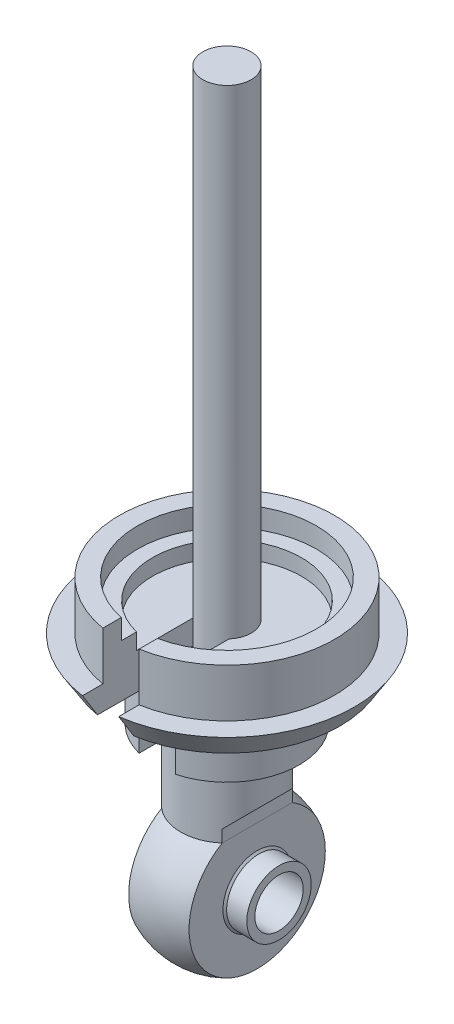
ISO-10303-21;
HEADER;
FILE_DESCRIPTION(('STEP AP214'),'2;1');
FILE_NAME('part.step','',(''),(''),'','','');
FILE_SCHEMA(('AUTOMOTIVE_DESIGN { 1 0 10303 214 1 1 1 1 }'));
ENDSEC;
DATA;
#1=APPLICATION_CONTEXT('core data for automotive mechanical design processes');
#2=APPLICATION_PROTOCOL_DEFINITION('international standard','automotive_design',2000,#1);
#3=PRODUCT_CONTEXT('',#1,'mechanical');
#4=PRODUCT('Part','Part','',(#3));
#5=PRODUCT_RELATED_PRODUCT_CATEGORY('part','',(#4));
#6=PRODUCT_DEFINITION_FORMATION('','',#4);
#7=PRODUCT_DEFINITION_CONTEXT('part definition',#1,'design');
#8=PRODUCT_DEFINITION('design','',#6,#7);
#9=PRODUCT_DEFINITION_SHAPE('','',#8);
#10=(LENGTH_UNIT() NAMED_UNIT(*) SI_UNIT(.MILLI.,.METRE.));
#11=(NAMED_UNIT(*) PLANE_ANGLE_UNIT() SI_UNIT($,.RADIAN.));
#12=(NAMED_UNIT(*) SI_UNIT($,.STERADIAN.) SOLID_ANGLE_UNIT());
#13=UNCERTAINTY_MEASURE_WITH_UNIT(LENGTH_MEASURE(1.E-05),#10,'distance_accuracy_value','');
#14=(GEOMETRIC_REPRESENTATION_CONTEXT(3) GLOBAL_UNCERTAINTY_ASSIGNED_CONTEXT((#13)) GLOBAL_UNIT_ASSIGNED_CONTEXT((#10,
#11,#12)) REPRESENTATION_CONTEXT('',''));
#15=CARTESIAN_POINT('',(0.,0.,0.));
#16=DIRECTION('',(0.,0.,1.));
#17=DIRECTION('',(1.,0.,0.));
#18=AXIS2_PLACEMENT_3D('',#15,#16,#17);
#19=CARTESIAN_POINT('',(9.86634888738536,-44.,0.));
#20=DIRECTION('',(1.,0.,0.));
#21=DIRECTION('',(0.,0.,-1.));
#22=AXIS2_PLACEMENT_3D('',#19,#20,#21);
#23=CYLINDRICAL_SURFACE('',#22,1.5);
#24=CARTESIAN_POINT('',(-3.23,-44.,0.));
#25=DIRECTION('',(1.,0.,0.));
#26=DIRECTION('',(0.,0.,-1.));
#27=AXIS2_PLACEMENT_3D('',#24,#25,#26);
#28=CIRCLE('',#27,1.5);
#29=CARTESIAN_POINT('',(-3.23,-44.,-1.5));
#30=VERTEX_POINT('',#29);
#31=EDGE_CURVE('E79',#30,#30,#28,.T.);
#32=ORIENTED_EDGE('',*,*,#31,.F.);
#33=EDGE_LOOP('',(#32));
#34=FACE_BOUND('',#33,.T.);
#35=CARTESIAN_POINT('',(3.23,-44.,0.));
#36=DIRECTION('',(1.,0.,0.));
#37=DIRECTION('',(0.,0.,-1.));
#38=AXIS2_PLACEMENT_3D('',#35,#36,#37);
#39=CIRCLE('',#38,1.5);
#40=CARTESIAN_POINT('',(3.23,-44.,-1.5));
#41=VERTEX_POINT('',#40);
#42=EDGE_CURVE('E11',#41,#41,#39,.T.);
#43=ORIENTED_EDGE('',*,*,#42,.T.);
#44=EDGE_LOOP('',(#43));
#45=FACE_BOUND('',#44,.T.);
#46=ADVANCED_FACE('F45',(#34,#45),#23,.F.);
#47=CARTESIAN_POINT('',(3.23,0.,0.));
#48=DIRECTION('',(-1.,0.,0.));
#49=DIRECTION('',(0.,0.,1.));
#50=AXIS2_PLACEMENT_3D('',#47,#48,#49);
#51=PLANE('',#50);
#52=ORIENTED_EDGE('',*,*,#42,.F.);
#53=EDGE_LOOP('',(#52));
#54=FACE_BOUND('',#53,.T.);
#55=CARTESIAN_POINT('',(3.23,-44.,0.));
#56=DIRECTION('',(1.,0.,0.));
#57=DIRECTION('',(0.,0.,-1.));
#58=AXIS2_PLACEMENT_3D('',#55,#56,#57);
#59=CIRCLE('',#58,2.);
#60=CARTESIAN_POINT('',(3.23,-44.,-2.));
#61=VERTEX_POINT('',#60);
#62=EDGE_CURVE('E51',#61,#61,#59,.T.);
#63=ORIENTED_EDGE('',*,*,#62,.T.);
#64=EDGE_LOOP('',(#63));
#65=FACE_BOUND('',#64,.T.);
#66=ADVANCED_FACE('F87',(#54,#65),#51,.F.);
#67=CARTESIAN_POINT('',(9.86634888738536,-44.,0.));
#68=DIRECTION('',(1.,0.,0.));
#69=DIRECTION('',(0.,0.,-1.));
#70=AXIS2_PLACEMENT_3D('',#67,#68,#69);
#71=CYLINDRICAL_SURFACE('',#70,2.);
#72=ORIENTED_EDGE('',*,*,#62,.F.);
#73=EDGE_LOOP('',(#72));
#74=FACE_BOUND('',#73,.T.);
#75=CARTESIAN_POINT('',(1.98,-44.,0.));
#76=DIRECTION('',(1.,0.,0.));
#77=DIRECTION('',(0.,0.,-1.));
#78=AXIS2_PLACEMENT_3D('',#75,#76,#77);
#79=CIRCLE('',#78,2.);
#80=CARTESIAN_POINT('',(1.98,-44.,-2.));
#81=VERTEX_POINT('',#80);
#82=EDGE_CURVE('E55',#81,#81,#79,.T.);
#83=ORIENTED_EDGE('',*,*,#82,.T.);
#84=EDGE_LOOP('',(#83));
#85=FACE_BOUND('',#84,.T.);
#86=ADVANCED_FACE('F91',(#74,#85),#71,.T.);
#87=CARTESIAN_POINT('',(0.,-44.,0.));
#88=DIRECTION('',(1.,0.,0.));
#89=DIRECTION('',(0.,0.,-1.));
#90=AXIS2_PLACEMENT_3D('',#87,#88,#89);
#91=DEGENERATE_TOROIDAL_SURFACE('',#90,0.473697277732887,2.5,.T.);
#92=CARTESIAN_POINT('',(1.875,-44.,0.));
#93=DIRECTION('',(1.,0.,0.));
#94=DIRECTION('',(0.,0.,-1.));
#95=AXIS2_PLACEMENT_3D('',#92,#93,#94);
#96=CIRCLE('',#95,2.12729184714826);
#97=CARTESIAN_POINT('',(1.875,-44.,-2.12729184714826));
#98=VERTEX_POINT('',#97);
#99=EDGE_CURVE('E59',#98,#98,#96,.T.);
#100=ORIENTED_EDGE('',*,*,#99,.T.);
#101=EDGE_LOOP('',(#100));
#102=FACE_BOUND('',#101,.T.);
#103=ORIENTED_EDGE('',*,*,#82,.F.);
#104=EDGE_LOOP('',(#103));
#105=FACE_BOUND('',#104,.T.);
#106=ADVANCED_FACE('F96',(#102,#105),#91,.T.);
#107=CARTESIAN_POINT('',(1.875,0.,0.));
#108=DIRECTION('',(-1.,0.,0.));
#109=DIRECTION('',(0.,0.,1.));
#110=AXIS2_PLACEMENT_3D('',#107,#108,#109);
#111=PLANE('',#110);
#112=ORIENTED_EDGE('',*,*,#99,.F.);
#113=EDGE_LOOP('',(#112));
#114=FACE_BOUND('',#113,.T.);
#115=CARTESIAN_POINT('',(1.875,-44.,0.));
#116=DIRECTION('',(1.,0.,0.));
#117=DIRECTION('',(0.,0.,-1.));
#118=AXIS2_PLACEMENT_3D('',#115,#116,#117);
#119=CIRCLE('',#118,4.22788363132194);
#120=CARTESIAN_POINT('',(1.875,-44.,-4.22788363132194));
#121=VERTEX_POINT('',#120);
#122=EDGE_CURVE('E64',#121,#121,#119,.T.);
#123=ORIENTED_EDGE('',*,*,#122,.T.);
#124=EDGE_LOOP('',(#123));
#125=FACE_BOUND('',#124,.T.);
#126=ADVANCED_FACE('F101',(#114,#125),#111,.F.);
#127=CARTESIAN_POINT('',(0.,-44.,0.));
#128=DIRECTION('',(1.,0.,0.));
#129=DIRECTION('',(0.,1.,0.));
#130=AXIS2_PLACEMENT_3D('',#127,#128,#129);
#131=SPHERICAL_SURFACE('',#130,4.625);
#132=CARTESIAN_POINT('',(-1.875,-44.,0.));
#133=DIRECTION('',(1.,0.,0.));
#134=DIRECTION('',(0.,0.,-1.));
#135=AXIS2_PLACEMENT_3D('',#132,#133,#134);
#136=CIRCLE('',#135,4.22788363132194);
#137=CARTESIAN_POINT('',(-1.875,-44.,-4.22788363132194));
#138=VERTEX_POINT('',#137);
#139=EDGE_CURVE('E67',#138,#138,#136,.T.);
#140=ORIENTED_EDGE('',*,*,#139,.T.);
#141=EDGE_LOOP('',(#140));
#142=FACE_BOUND('',#141,.T.);
#143=ORIENTED_EDGE('',*,*,#122,.F.);
#144=EDGE_LOOP('',(#143));
#145=FACE_BOUND('',#144,.T.);
#146=ADVANCED_FACE('F104',(#142,#145),#131,.T.);
#147=CARTESIAN_POINT('',(-1.875,0.,0.));
#148=DIRECTION('',(-1.,0.,0.));
#149=DIRECTION('',(0.,0.,1.));
#150=AXIS2_PLACEMENT_3D('',#147,#148,#149);
#151=PLANE('',#150);
#152=CARTESIAN_POINT('',(-1.875,-44.,0.));
#153=DIRECTION('',(1.,0.,0.));
#154=DIRECTION('',(0.,0.,-1.));
#155=AXIS2_PLACEMENT_3D('',#152,#153,#154);
#156=CIRCLE('',#155,2.12729184714826);
#157=CARTESIAN_POINT('',(-1.875,-44.,-2.12729184714826));
#158=VERTEX_POINT('',#157);
#159=EDGE_CURVE('E70',#158,#158,#156,.T.);
#160=ORIENTED_EDGE('',*,*,#159,.T.);
#161=EDGE_LOOP('',(#160));
#162=FACE_BOUND('',#161,.T.);
#163=ORIENTED_EDGE('',*,*,#139,.F.);
#164=EDGE_LOOP('',(#163));
#165=FACE_BOUND('',#164,.T.);
#166=ADVANCED_FACE('F108',(#162,#165),#151,.T.);
#167=CARTESIAN_POINT('',(-1.98,-44.,0.));
#168=DIRECTION('',(1.,0.,0.));
#169=DIRECTION('',(0.,0.,-1.));
#170=AXIS2_PLACEMENT_3D('',#167,#168,#169);
#171=CIRCLE('',#170,2.);
#172=CARTESIAN_POINT('',(-1.98,-44.,-2.));
#173=VERTEX_POINT('',#172);
#174=EDGE_CURVE('E73',#173,#173,#171,.T.);
#175=ORIENTED_EDGE('',*,*,#174,.T.);
#176=EDGE_LOOP('',(#175));
#177=FACE_BOUND('',#176,.T.);
#178=ORIENTED_EDGE('',*,*,#159,.F.);
#179=EDGE_LOOP('',(#178));
#180=FACE_BOUND('',#179,.T.);
#181=ADVANCED_FACE('F112',(#177,#180),#91,.T.);
#182=ORIENTED_EDGE('',*,*,#174,.F.);
#183=EDGE_LOOP('',(#182));
#184=FACE_BOUND('',#183,.T.);
#185=CARTESIAN_POINT('',(-3.23,-44.,0.));
#186=DIRECTION('',(1.,0.,0.));
#187=DIRECTION('',(0.,0.,-1.));
#188=AXIS2_PLACEMENT_3D('',#185,#186,#187);
#189=CIRCLE('',#188,2.);
#190=CARTESIAN_POINT('',(-3.23,-44.,-2.));
#191=VERTEX_POINT('',#190);
#192=EDGE_CURVE('E76',#191,#191,#189,.T.);
#193=ORIENTED_EDGE('',*,*,#192,.T.);
#194=EDGE_LOOP('',(#193));
#195=FACE_BOUND('',#194,.T.);
#196=ADVANCED_FACE('F99',(#184,#195),#71,.T.);
#197=CARTESIAN_POINT('',(-3.23,0.,0.));
#198=DIRECTION('',(-1.,0.,0.));
#199=DIRECTION('',(0.,0.,1.));
#200=AXIS2_PLACEMENT_3D('',#197,#198,#199);
#201=PLANE('',#200);
#202=ORIENTED_EDGE('',*,*,#31,.T.);
#203=EDGE_LOOP('',(#202));
#204=FACE_BOUND('',#203,.T.);
#205=ORIENTED_EDGE('',*,*,#192,.F.);
#206=EDGE_LOOP('',(#205));
#207=FACE_BOUND('',#206,.T.);
#208=ADVANCED_FACE('F83',(#204,#207),#201,.T.);
#209=CLOSED_SHELL('',(#46,#66,#86,#106,#126,#146,#166,#181,#196,#208));
#210=MANIFOLD_SOLID_BREP('B2',#209);
#211=CARTESIAN_POINT('',(0.,-30.3742009649397,0.));
#212=DIRECTION('',(0.,1.,0.));
#213=DIRECTION('',(0.,0.,1.));
#214=AXIS2_PLACEMENT_3D('',#211,#212,#213);
#215=PLANE('',#214);
#216=CARTESIAN_POINT('',(0.,-30.3742009649397,0.));
#217=DIRECTION('',(0.,-1.,0.));
#218=DIRECTION('',(0.,0.,-1.));
#219=AXIS2_PLACEMENT_3D('',#216,#217,#218);
#220=CIRCLE('',#219,4.625);
#221=CARTESIAN_POINT('',(-1.125,-30.3742009649397,4.48608961123159));
#222=VERTEX_POINT('',#221);
#223=CARTESIAN_POINT('',(1.125,-30.3742009649397,4.48608961123159));
#224=VERTEX_POINT('',#223);
#225=EDGE_CURVE('E488',#222,#224,#220,.T.);
#226=ORIENTED_EDGE('',*,*,#225,.F.);
#227=DIRECTION('',(0.,0.,-1.));
#228=VECTOR('',#227,1.);
#229=CARTESIAN_POINT('',(-1.125,-30.3742009649397,0.));
#230=LINE('',#229,#228);
#231=CARTESIAN_POINT('',(-1.125,-30.3742009649397,0.992156741649238));
#232=VERTEX_POINT('',#231);
#233=EDGE_CURVE('E483',#222,#232,#230,.T.);
#234=ORIENTED_EDGE('',*,*,#233,.T.);
#235=CARTESIAN_POINT('',(0.,-30.3742009649397,0.));
#236=DIRECTION('',(0.,1.,0.));
#237=DIRECTION('',(0.,0.,1.));
#238=AXIS2_PLACEMENT_3D('',#235,#236,#237);
#239=CIRCLE('',#238,1.50000000000001);
#240=CARTESIAN_POINT('',(1.125,-30.3742009649397,0.992156741649238));
#241=VERTEX_POINT('',#240);
#242=EDGE_CURVE('E413',#232,#241,#239,.F.);
#243=ORIENTED_EDGE('',*,*,#242,.T.);
#244=DIRECTION('',(0.,0.,1.));
#245=VECTOR('',#244,1.);
#246=CARTESIAN_POINT('',(1.125,-30.3742009649397,0.));
#247=LINE('',#246,#245);
#248=EDGE_CURVE('E456',#241,#224,#247,.T.);
#249=ORIENTED_EDGE('',*,*,#248,.T.);
#250=EDGE_LOOP('',(#226,#234,#243,#249));
#251=FACE_BOUND('',#250,.T.);
#252=ADVANCED_FACE('F210',(#251),#215,.T.);
#253=CARTESIAN_POINT('',(0.,-31.7578523954355,0.));
#254=DIRECTION('',(0.,1.,0.));
#255=DIRECTION('',(0.,0.,1.));
#256=AXIS2_PLACEMENT_3D('',#253,#254,#255);
#257=PLANE('',#256);
#258=DIRECTION('',(0.,0.,-1.));
#259=VECTOR('',#258,1.);
#260=CARTESIAN_POINT('',(-1.125,-31.7578523954355,0.));
#261=LINE('',#260,#259);
#262=CARTESIAN_POINT('',(-1.125,-31.7578523954355,2.7270634389394));
#263=VERTEX_POINT('',#262);
#264=CARTESIAN_POINT('',(-1.125,-31.7578523954355,2.64575131106458));
#265=VERTEX_POINT('',#264);
#266=EDGE_CURVE('E541',#263,#265,#261,.T.);
#267=ORIENTED_EDGE('',*,*,#266,.F.);
#268=CARTESIAN_POINT('',(0.,-31.7578523954355,0.));
#269=DIRECTION('',(0.,-1.,0.));
#270=DIRECTION('',(0.,0.,-1.));
#271=AXIS2_PLACEMENT_3D('',#268,#269,#270);
#272=CIRCLE('',#271,2.95);
#273=CARTESIAN_POINT('',(1.125,-31.7578523954355,2.7270634389394));
#274=VERTEX_POINT('',#273);
#275=EDGE_CURVE('E373',#263,#274,#272,.T.);
#276=ORIENTED_EDGE('',*,*,#275,.T.);
#277=DIRECTION('',(0.,0.,1.));
#278=VECTOR('',#277,1.);
#279=CARTESIAN_POINT('',(1.125,-31.7578523954355,0.));
#280=LINE('',#279,#278);
#281=CARTESIAN_POINT('',(1.125,-31.7578523954355,2.64575131106458));
#282=VERTEX_POINT('',#281);
#283=EDGE_CURVE('E352',#282,#274,#280,.T.);
#284=ORIENTED_EDGE('',*,*,#283,.F.);
#285=CARTESIAN_POINT('',(0.,-31.7578523954355,0.));
#286=DIRECTION('',(0.,1.,0.));
#287=DIRECTION('',(0.,0.,1.));
#288=AXIS2_PLACEMENT_3D('',#285,#286,#287);
#289=CIRCLE('',#288,2.875);
#290=EDGE_CURVE('E375',#265,#282,#289,.F.);
#291=ORIENTED_EDGE('',*,*,#290,.F.);
#292=EDGE_LOOP('',(#267,#276,#284,#291));
#293=FACE_BOUND('',#292,.T.);
#294=ADVANCED_FACE('F429',(#293),#257,.F.);
#295=CARTESIAN_POINT('',(0.,-44.,0.));
#296=DIRECTION('',(0.,-1.,0.));
#297=DIRECTION('',(0.,0.,-1.));
#298=AXIS2_PLACEMENT_3D('',#295,#296,#297);
#299=CYLINDRICAL_SURFACE('',#298,2.95);
#300=DIRECTION('',(0.,-1.,0.));
#301=VECTOR('',#300,1.);
#302=CARTESIAN_POINT('',(-1.125,-44.,2.7270634389394));
#303=LINE('',#302,#301);
#304=CARTESIAN_POINT('',(-1.125,-35.9742009649397,2.7270634389394));
#305=VERTEX_POINT('',#304);
#306=EDGE_CURVE('E371',#305,#263,#303,.F.);
#307=ORIENTED_EDGE('',*,*,#306,.F.);
#308=CARTESIAN_POINT('',(0.,-35.9742009649397,0.));
#309=DIRECTION('',(0.,-1.,0.));
#310=DIRECTION('',(0.,0.,-1.));
#311=AXIS2_PLACEMENT_3D('',#308,#309,#310);
#312=CIRCLE('',#311,2.95);
#313=CARTESIAN_POINT('',(1.125,-35.9742009649397,2.7270634389394));
#314=VERTEX_POINT('',#313);
#315=EDGE_CURVE('E364',#305,#314,#312,.T.);
#316=ORIENTED_EDGE('',*,*,#315,.T.);
#317=DIRECTION('',(0.,-1.,0.));
#318=VECTOR('',#317,1.);
#319=CARTESIAN_POINT('',(1.125,-44.,2.7270634389394));
#320=LINE('',#319,#318);
#321=EDGE_CURVE('E346',#274,#314,#320,.T.);
#322=ORIENTED_EDGE('',*,*,#321,.F.);
#323=ORIENTED_EDGE('',*,*,#275,.F.);
#324=EDGE_LOOP('',(#307,#316,#322,#323));
#325=FACE_BOUND('',#324,.T.);
#326=ADVANCED_FACE('F370',(#325),#299,.F.);
#327=CARTESIAN_POINT('',(0.,-32.6242009649397,0.));
#328=DIRECTION('',(0.,1.,0.));
#329=DIRECTION('',(0.,0.,1.));
#330=AXIS2_PLACEMENT_3D('',#327,#328,#329);
#331=CONICAL_SURFACE('',#330,7.,0.552584350290713);
#332=CARTESIAN_POINT('',(0.,-32.6242009649397,0.));
#333=DIRECTION('',(0.,-1.,0.));
#334=DIRECTION('',(0.,0.,-1.));
#335=AXIS2_PLACEMENT_3D('',#332,#333,#334);
#336=CIRCLE('',#335,7.);
#337=CARTESIAN_POINT('',(-1.125,-32.6242009649397,6.90900680271774));
#338=VERTEX_POINT('',#337);
#339=CARTESIAN_POINT('',(1.125,-32.6242009649397,6.90900680271774));
#340=VERTEX_POINT('',#339);
#341=EDGE_CURVE('E509',#338,#340,#336,.T.);
#342=ORIENTED_EDGE('',*,*,#341,.F.);
#343=CARTESIAN_POINT('',(-1.125,-40.199465632799,2.0387965641433));
#344=CARTESIAN_POINT('',(-1.125,-40.1593634360158,2.06703894520516));
#345=CARTESIAN_POINT('',(-1.125,-40.1191985316713,2.09519210390353));
#346=CARTESIAN_POINT('',(-1.125,-39.9712681889384,2.19843419539251));
#347=CARTESIAN_POINT('',(-1.125,-39.8631501965063,2.27301841429167));
#348=CARTESIAN_POINT('',(-1.125,-39.6463074235207,2.42130032890089));
#349=CARTESIAN_POINT('',(-1.125,-39.5375826343965,2.49499801204255));
#350=CARTESIAN_POINT('',(-1.125,-39.2107077699713,2.71506958280123));
#351=CARTESIAN_POINT('',(-1.125,-38.9918661222191,2.86041581871792));
#352=CARTESIAN_POINT('',(-1.125,-38.5529997535667,3.14938504446326));
#353=CARTESIAN_POINT('',(-1.125,-38.3329748394766,3.29300773970979));
#354=CARTESIAN_POINT('',(-1.125,-37.8921516920477,3.57904783109189));
#355=CARTESIAN_POINT('',(-1.125,-37.6713534791121,3.72146525869416));
#356=CARTESIAN_POINT('',(-1.125,-37.2141206271276,4.0151356127692));
#357=CARTESIAN_POINT('',(-1.125,-36.9776472701952,4.16632819007415));
#358=CARTESIAN_POINT('',(-1.125,-36.5042484457369,4.46800429934888));
#359=CARTESIAN_POINT('',(-1.125,-36.267322977443,4.61848783011287));
#360=CARTESIAN_POINT('',(-1.125,-35.5560439684049,5.06915793806483));
#361=CARTESIAN_POINT('',(-1.125,-35.0811937088283,5.36856026546654));
#362=CARTESIAN_POINT('',(-1.125,-34.1307690911185,5.96608172743233));
#363=CARTESIAN_POINT('',(-1.125,-33.655194829098,6.26420101510487));
#364=CARTESIAN_POINT('',(-1.125,-32.7035363169041,6.85961831298288));
#365=CARTESIAN_POINT('',(-1.125,-32.2274520696197,7.15691632780709));
#366=CARTESIAN_POINT('',(-1.125,-31.0521249527681,7.88991212508793));
#367=CARTESIAN_POINT('',(-1.125,-30.3526815933789,8.32528831596891));
#368=CARTESIAN_POINT('',(-1.125,-28.9533332607503,9.19530163131332));
#369=CARTESIAN_POINT('',(-1.125,-28.2534282864076,9.6299387540014));
#370=CARTESIAN_POINT('',(-1.125,-26.8532313528406,10.4987728369882));
#371=CARTESIAN_POINT('',(-1.125,-26.1529393578116,10.9329697395748));
#372=CARTESIAN_POINT('',(-1.125,-24.752138722228,11.8010091496466));
#373=CARTESIAN_POINT('',(-1.125,-24.0516300823459,12.2348516582173));
#374=CARTESIAN_POINT('',(-1.125,-23.3510550488242,12.6685867627639));
#375=B_SPLINE_CURVE_WITH_KNOTS('',3,(#343,#344,#345,#346,#347,#348,#349,#350,#351,#352,#353,
#354,#355,#356,#357,#358,#359,#360,#361,#362,#363,#364,#365,#366,#367,#368,#369,#370,#371,#372,
#373,#374),.UNSPECIFIED.,.F.,.F.,(4,2,2,2,2,2,2,2,2,2,2,2,2,2,2,4),(0.,0.147147174325833,
0.541184231020217,0.935226867402654,1.72334469193015,2.51159535364628,3.29982537210985,
4.14185080242315,4.98387766413813,6.66795234779673,8.35182016120362,10.0356784853914,
12.5073089222215,14.9789452879467,17.4508720366363,19.9227911863017),.UNSPECIFIED.);
#376=CARTESIAN_POINT('',(-1.125,-31.1242009649397,7.84474346298207));
#377=VERTEX_POINT('',#376);
#378=EDGE_CURVE('E476',#338,#377,#375,.T.);
#379=ORIENTED_EDGE('',*,*,#378,.T.);
#380=CARTESIAN_POINT('',(0.,-31.1242009649397,0.));
#381=DIRECTION('',(0.,-1.,0.));
#382=DIRECTION('',(0.,0.,-1.));
#383=AXIS2_PLACEMENT_3D('',#380,#381,#382);
#384=CIRCLE('',#383,7.925);
#385=CARTESIAN_POINT('',(1.125,-31.1242009649397,7.84474346298207));
#386=VERTEX_POINT('',#385);
#387=EDGE_CURVE('E506',#377,#386,#384,.T.);
#388=ORIENTED_EDGE('',*,*,#387,.T.);
#389=CARTESIAN_POINT('',(1.125,-23.3510550488242,12.6685867627639));
#390=CARTESIAN_POINT('',(1.125,-24.0512265346675,12.2351021259405));
#391=CARTESIAN_POINT('',(1.125,-24.7513312686327,11.8015095438299));
#392=CARTESIAN_POINT('',(1.125,-26.1513535339878,10.9339524102971));
#393=CARTESIAN_POINT('',(1.125,-26.8512710556087,10.4999878431114));
#394=CARTESIAN_POINT('',(1.125,-28.2514981971625,9.63113775906099));
#395=CARTESIAN_POINT('',(1.125,-28.9518075152194,9.19625175554034));
#396=CARTESIAN_POINT('',(1.125,-30.3519320280238,8.32575282221733));
#397=CARTESIAN_POINT('',(1.125,-31.0517472429365,7.89013992485205));
#398=CARTESIAN_POINT('',(1.125,-32.4505882319587,7.01776464222007));
#399=CARTESIAN_POINT('',(1.125,-33.1496140617373,6.5810023463215));
#400=CARTESIAN_POINT('',(1.125,-34.1972018183369,5.92423708590508));
#401=CARTESIAN_POINT('',(1.125,-34.5462627060734,5.7050302179835));
#402=CARTESIAN_POINT('',(1.125,-35.2439058887771,5.2658659945509));
#403=CARTESIAN_POINT('',(1.125,-35.5924881900971,5.04590864913975));
#404=CARTESIAN_POINT('',(1.125,-36.2887518257962,4.60503130670956));
#405=CARTESIAN_POINT('',(1.125,-36.6364335742357,4.38411196385348));
#406=CARTESIAN_POINT('',(1.125,-37.3307547988813,3.94059744445598));
#407=CARTESIAN_POINT('',(1.125,-37.6773942203455,3.71800218197635));
#408=CARTESIAN_POINT('',(1.125,-38.1959599550109,3.38204215627186));
#409=CARTESIAN_POINT('',(1.125,-38.3685637159682,3.26972365269421));
#410=CARTESIAN_POINT('',(1.125,-38.7131519852354,3.0441413801537));
#411=CARTESIAN_POINT('',(1.125,-38.8851364972114,2.93087761680032));
#412=CARTESIAN_POINT('',(1.125,-39.2282272429737,2.70305698350866));
#413=CARTESIAN_POINT('',(1.125,-39.3993335478547,2.58850022072527));
#414=CARTESIAN_POINT('',(1.125,-39.740282738697,2.35752358904509));
#415=CARTESIAN_POINT('',(1.125,-39.9101256667892,2.2411037826885));
#416=CARTESIAN_POINT('',(1.125,-40.0990874822178,2.10922809594207));
#417=CARTESIAN_POINT('',(1.125,-40.119184395391,2.09517256808498));
#418=CARTESIAN_POINT('',(1.125,-40.1593481848329,2.06701794240413));
#419=CARTESIAN_POINT('',(1.125,-40.1794150605872,2.05291884384671));
#420=CARTESIAN_POINT('',(1.125,-40.199465632799,2.03879656414331));
#421=B_SPLINE_CURVE_WITH_KNOTS('',3,(#389,#390,#391,#392,#393,#394,#395,#396,#397,#398,#399,
#400,#401,#402,#403,#404,#405,#406,#407,#408,#409,#410,#411,#412,#413,#414,#415,#416,#417,#418,
#419,#420),.UNSPECIFIED.,.F.,.F.,(4,2,2,2,2,2,2,2,2,2,2,2,2,2,2,4),(0.,2.47049423825209,
4.94109892804053,7.41415959187893,9.88711270067529,12.359878900708,13.5964285018356,
14.8329615266846,16.0687552665326,17.3046128132597,17.9224032358612,18.5401899949059,
19.1579259265573,19.775641164849,19.8492141719928,19.9227884248181),.UNSPECIFIED.);
#422=EDGE_CURVE('E449',#386,#340,#421,.T.);
#423=ORIENTED_EDGE('',*,*,#422,.T.);
#424=EDGE_LOOP('',(#342,#379,#388,#423));
#425=FACE_BOUND('',#424,.T.);
#426=ADVANCED_FACE('F458',(#425),#331,.T.);
#427=CARTESIAN_POINT('',(0.,-31.1242009649397,0.));
#428=DIRECTION('',(0.,1.,0.));
#429=DIRECTION('',(0.,0.,1.));
#430=AXIS2_PLACEMENT_3D('',#427,#428,#429);
#431=PLANE('',#430);
#432=ORIENTED_EDGE('',*,*,#387,.F.);
#433=DIRECTION('',(0.,0.,-1.));
#434=VECTOR('',#433,1.);
#435=CARTESIAN_POINT('',(-1.125,-31.1242009649397,0.));
#436=LINE('',#435,#434);
#437=CARTESIAN_POINT('',(-1.125,-31.1242009649397,6.57951365983839));
#438=VERTEX_POINT('',#437);
#439=EDGE_CURVE('E484',#377,#438,#436,.T.);
#440=ORIENTED_EDGE('',*,*,#439,.T.);
#441=CARTESIAN_POINT('',(0.,-31.1242009649397,0.));
#442=DIRECTION('',(0.,-1.,0.));
#443=DIRECTION('',(0.,0.,-1.));
#444=AXIS2_PLACEMENT_3D('',#441,#442,#443);
#445=CIRCLE('',#444,6.675);
#446=CARTESIAN_POINT('',(1.125,-31.1242009649397,6.57951365983839));
#447=VERTEX_POINT('',#446);
#448=EDGE_CURVE('E503',#438,#447,#445,.T.);
#449=ORIENTED_EDGE('',*,*,#448,.T.);
#450=DIRECTION('',(0.,0.,1.));
#451=VECTOR('',#450,1.);
#452=CARTESIAN_POINT('',(1.125,-31.1242009649397,0.));
#453=LINE('',#452,#451);
#454=EDGE_CURVE('E446',#447,#386,#453,.T.);
#455=ORIENTED_EDGE('',*,*,#454,.T.);
#456=EDGE_LOOP('',(#432,#440,#449,#455));
#457=FACE_BOUND('',#456,.T.);
#458=ADVANCED_FACE('F561',(#457),#431,.T.);
#459=CARTESIAN_POINT('',(0.,-44.,0.));
#460=DIRECTION('',(0.,-1.,0.));
#461=DIRECTION('',(0.,0.,-1.));
#462=AXIS2_PLACEMENT_3D('',#459,#460,#461);
#463=CYLINDRICAL_SURFACE('',#462,6.675);
#464=DIRECTION('',(0.,-1.,0.));
#465=VECTOR('',#464,1.);
#466=CARTESIAN_POINT('',(-1.125,-44.,6.57951365983839));
#467=LINE('',#466,#465);
#468=CARTESIAN_POINT('',(-1.125,-28.1242009649397,6.57951365983839));
#469=VERTEX_POINT('',#468);
#470=EDGE_CURVE('E555',#469,#438,#467,.T.);
#471=ORIENTED_EDGE('',*,*,#470,.F.);
#472=CARTESIAN_POINT('',(0.,-28.1242009649397,0.));
#473=DIRECTION('',(0.,-1.,0.));
#474=DIRECTION('',(0.,0.,-1.));
#475=AXIS2_PLACEMENT_3D('',#472,#473,#474);
#476=CIRCLE('',#475,6.675);
#477=CARTESIAN_POINT('',(1.125,-28.1242009649397,6.57951365983839));
#478=VERTEX_POINT('',#477);
#479=EDGE_CURVE('E500',#469,#478,#476,.T.);
#480=ORIENTED_EDGE('',*,*,#479,.T.);
#481=DIRECTION('',(0.,-1.,0.));
#482=VECTOR('',#481,1.);
#483=CARTESIAN_POINT('',(1.125,-44.,6.57951365983839));
#484=LINE('',#483,#482);
#485=EDGE_CURVE('E444',#447,#478,#484,.F.);
#486=ORIENTED_EDGE('',*,*,#485,.F.);
#487=ORIENTED_EDGE('',*,*,#448,.F.);
#488=EDGE_LOOP('',(#471,#480,#486,#487));
#489=FACE_BOUND('',#488,.T.);
#490=ADVANCED_FACE('F564',(#489),#463,.T.);
#491=CARTESIAN_POINT('',(0.,-28.1242009649397,0.));
#492=DIRECTION('',(0.,1.,0.));
#493=DIRECTION('',(0.,0.,1.));
#494=AXIS2_PLACEMENT_3D('',#491,#492,#493);
#495=PLANE('',#494);
#496=ORIENTED_EDGE('',*,*,#479,.F.);
#497=DIRECTION('',(0.,0.,-1.));
#498=VECTOR('',#497,1.);
#499=CARTESIAN_POINT('',(-1.125,-28.1242009649397,0.));
#500=LINE('',#499,#498);
#501=CARTESIAN_POINT('',(-1.125,-28.1242009649397,5.4347838043477));
#502=VERTEX_POINT('',#501);
#503=EDGE_CURVE('E553',#469,#502,#500,.T.);
#504=ORIENTED_EDGE('',*,*,#503,.T.);
#505=CARTESIAN_POINT('',(0.,-28.1242009649397,0.));
#506=DIRECTION('',(0.,-1.,0.));
#507=DIRECTION('',(0.,0.,-1.));
#508=AXIS2_PLACEMENT_3D('',#505,#506,#507);
#509=CIRCLE('',#508,5.55);
#510=CARTESIAN_POINT('',(1.125,-28.1242009649397,5.4347838043477));
#511=VERTEX_POINT('',#510);
#512=EDGE_CURVE('E497',#502,#511,#509,.T.);
#513=ORIENTED_EDGE('',*,*,#512,.T.);
#514=DIRECTION('',(0.,0.,1.));
#515=VECTOR('',#514,1.);
#516=CARTESIAN_POINT('',(1.125,-28.1242009649397,0.));
#517=LINE('',#516,#515);
#518=EDGE_CURVE('E441',#511,#478,#517,.T.);
#519=ORIENTED_EDGE('',*,*,#518,.T.);
#520=EDGE_LOOP('',(#496,#504,#513,#519));
#521=FACE_BOUND('',#520,.T.);
#522=ADVANCED_FACE('F567',(#521),#495,.T.);
#523=CARTESIAN_POINT('',(0.,-44.,0.));
#524=DIRECTION('',(0.,-1.,0.));
#525=DIRECTION('',(0.,0.,-1.));
#526=AXIS2_PLACEMENT_3D('',#523,#524,#525);
#527=CYLINDRICAL_SURFACE('',#526,5.55);
#528=ORIENTED_EDGE('',*,*,#512,.F.);
#529=DIRECTION('',(0.,-1.,0.));
#530=VECTOR('',#529,1.);
#531=CARTESIAN_POINT('',(-1.125,-44.,5.4347838043477));
#532=LINE('',#531,#530);
#533=CARTESIAN_POINT('',(-1.125,-29.3742009649397,5.4347838043477));
#534=VERTEX_POINT('',#533);
#535=EDGE_CURVE('E550',#502,#534,#532,.T.);
#536=ORIENTED_EDGE('',*,*,#535,.T.);
#537=CARTESIAN_POINT('',(0.,-29.3742009649397,0.));
#538=DIRECTION('',(0.,-1.,0.));
#539=DIRECTION('',(0.,0.,-1.));
#540=AXIS2_PLACEMENT_3D('',#537,#538,#539);
#541=CIRCLE('',#540,5.55);
#542=CARTESIAN_POINT('',(1.125,-29.3742009649397,5.4347838043477));
#543=VERTEX_POINT('',#542);
#544=EDGE_CURVE('E494',#534,#543,#541,.T.);
#545=ORIENTED_EDGE('',*,*,#544,.T.);
#546=DIRECTION('',(0.,-1.,0.));
#547=VECTOR('',#546,1.);
#548=CARTESIAN_POINT('',(1.125,-44.,5.4347838043477));
#549=LINE('',#548,#547);
#550=EDGE_CURVE('E438',#543,#511,#549,.F.);
#551=ORIENTED_EDGE('',*,*,#550,.T.);
#552=EDGE_LOOP('',(#528,#536,#545,#551));
#553=FACE_BOUND('',#552,.T.);
#554=ADVANCED_FACE('F570',(#553),#527,.F.);
#555=CARTESIAN_POINT('',(0.,-29.3742009649397,0.));
#556=DIRECTION('',(0.,1.,0.));
#557=DIRECTION('',(0.,0.,1.));
#558=AXIS2_PLACEMENT_3D('',#555,#556,#557);
#559=PLANE('',#558);
#560=ORIENTED_EDGE('',*,*,#544,.F.);
#561=DIRECTION('',(0.,0.,-1.));
#562=VECTOR('',#561,1.);
#563=CARTESIAN_POINT('',(-1.125,-29.3742009649397,0.));
#564=LINE('',#563,#562);
#565=CARTESIAN_POINT('',(-1.125,-29.3742009649397,4.48608961123159));
#566=VERTEX_POINT('',#565);
#567=EDGE_CURVE('E547',#534,#566,#564,.T.);
#568=ORIENTED_EDGE('',*,*,#567,.T.);
#569=CARTESIAN_POINT('',(0.,-29.3742009649397,0.));
#570=DIRECTION('',(0.,-1.,0.));
#571=DIRECTION('',(0.,0.,-1.));
#572=AXIS2_PLACEMENT_3D('',#569,#570,#571);
#573=CIRCLE('',#572,4.625);
#574=CARTESIAN_POINT('',(1.125,-29.3742009649397,4.48608961123159));
#575=VERTEX_POINT('',#574);
#576=EDGE_CURVE('E491',#566,#575,#573,.T.);
#577=ORIENTED_EDGE('',*,*,#576,.T.);
#578=DIRECTION('',(0.,0.,1.));
#579=VECTOR('',#578,1.);
#580=CARTESIAN_POINT('',(1.125,-29.3742009649397,0.));
#581=LINE('',#580,#579);
#582=EDGE_CURVE('E225',#575,#543,#581,.T.);
#583=ORIENTED_EDGE('',*,*,#582,.T.);
#584=EDGE_LOOP('',(#560,#568,#577,#583));
#585=FACE_BOUND('',#584,.T.);
#586=ADVANCED_FACE('F573',(#585),#559,.T.);
#587=CARTESIAN_POINT('',(0.,-44.,0.));
#588=DIRECTION('',(0.,-1.,0.));
#589=DIRECTION('',(0.,0.,-1.));
#590=AXIS2_PLACEMENT_3D('',#587,#588,#589);
#591=CYLINDRICAL_SURFACE('',#590,4.625);
#592=ORIENTED_EDGE('',*,*,#576,.F.);
#593=DIRECTION('',(0.,-1.,0.));
#594=VECTOR('',#593,1.);
#595=CARTESIAN_POINT('',(-1.125,-44.,4.48608961123159));
#596=LINE('',#595,#594);
#597=EDGE_CURVE('E542',#566,#222,#596,.T.);
#598=ORIENTED_EDGE('',*,*,#597,.T.);
#599=ORIENTED_EDGE('',*,*,#225,.T.);
#600=DIRECTION('',(0.,-1.,0.));
#601=VECTOR('',#600,1.);
#602=CARTESIAN_POINT('',(1.125,-44.,4.48608961123159));
#603=LINE('',#602,#601);
#604=EDGE_CURVE('E357',#224,#575,#603,.F.);
#605=ORIENTED_EDGE('',*,*,#604,.T.);
#606=EDGE_LOOP('',(#592,#598,#599,#605));
#607=FACE_BOUND('',#606,.T.);
#608=ADVANCED_FACE('F473',(#607),#591,.F.);
#609=CARTESIAN_POINT('',(0.,-44.,0.));
#610=DIRECTION('',(0.,-1.,0.));
#611=DIRECTION('',(0.,0.,-1.));
#612=AXIS2_PLACEMENT_3D('',#609,#610,#611);
#613=CYLINDRICAL_SURFACE('',#612,2.875);
#614=DIRECTION('',(0.,-1.,0.));
#615=VECTOR('',#614,1.);
#616=CARTESIAN_POINT('',(-1.875,-44.,2.17944947177032));
#617=LINE('',#616,#615);
#618=CARTESIAN_POINT('',(-1.875,-40.3771558134526,2.17944947177032));
#619=VERTEX_POINT('',#618);
#620=CARTESIAN_POINT('',(-1.875,-39.625,2.17944947177032));
#621=VERTEX_POINT('',#620);
#622=EDGE_CURVE('E386',#619,#621,#617,.F.);
#623=ORIENTED_EDGE('',*,*,#622,.F.);
#624=CARTESIAN_POINT('',(0.,-40.3771558134526,0.));
#625=DIRECTION('',(0.,-1.,0.));
#626=DIRECTION('',(0.,0.,-1.));
#627=AXIS2_PLACEMENT_3D('',#624,#625,#626);
#628=CIRCLE('',#627,2.875);
#629=CARTESIAN_POINT('',(1.875,-40.3771558134526,2.17944947177032));
#630=VERTEX_POINT('',#629);
#631=EDGE_CURVE('E398',#630,#619,#628,.T.);
#632=ORIENTED_EDGE('',*,*,#631,.F.);
#633=DIRECTION('',(0.,-1.,0.));
#634=VECTOR('',#633,1.);
#635=CARTESIAN_POINT('',(1.875,-44.,2.17944947177032));
#636=LINE('',#635,#634);
#637=CARTESIAN_POINT('',(1.875,-39.625,2.17944947177032));
#638=VERTEX_POINT('',#637);
#639=EDGE_CURVE('E392',#638,#630,#636,.T.);
#640=ORIENTED_EDGE('',*,*,#639,.F.);
#641=CARTESIAN_POINT('',(0.,-41.5,0.));
#642=DIRECTION('',(-0.707106781186548,0.707106781186547,0.));
#643=DIRECTION('',(-0.707106781186547,-0.707106781186548,0.));
#644=AXIS2_PLACEMENT_3D('',#641,#642,#643);
#645=ELLIPSE('',#644,4.06586399182265,2.875);
#646=CARTESIAN_POINT('',(1.875,-39.625,-2.17944947177035));
#647=VERTEX_POINT('',#646);
#648=EDGE_CURVE('E407',#647,#638,#645,.F.);
#649=ORIENTED_EDGE('',*,*,#648,.F.);
#650=DIRECTION('',(0.,-1.,0.));
#651=VECTOR('',#650,1.);
#652=CARTESIAN_POINT('',(1.875,-44.,-2.17944947177035));
#653=LINE('',#652,#651);
#654=CARTESIAN_POINT('',(1.875,-40.3771558134526,-2.17944947177035));
#655=VERTEX_POINT('',#654);
#656=EDGE_CURVE('E394',#655,#647,#653,.F.);
#657=ORIENTED_EDGE('',*,*,#656,.F.);
#658=CARTESIAN_POINT('',(-1.875,-40.3771558134526,-2.17944947177035));
#659=VERTEX_POINT('',#658);
#660=EDGE_CURVE('E397',#659,#655,#628,.T.);
#661=ORIENTED_EDGE('',*,*,#660,.F.);
#662=DIRECTION('',(0.,-1.,0.));
#663=VECTOR('',#662,1.);
#664=CARTESIAN_POINT('',(-1.875,-44.,-2.17944947177035));
#665=LINE('',#664,#663);
#666=CARTESIAN_POINT('',(-1.875,-39.625,-2.17944947177035));
#667=VERTEX_POINT('',#666);
#668=EDGE_CURVE('E384',#667,#659,#665,.T.);
#669=ORIENTED_EDGE('',*,*,#668,.F.);
#670=CARTESIAN_POINT('',(0.,-41.5,0.));
#671=DIRECTION('',(0.707106781186547,0.707106781186548,0.));
#672=DIRECTION('',(0.707106781186548,-0.707106781186547,0.));
#673=AXIS2_PLACEMENT_3D('',#670,#671,#672);
#674=ELLIPSE('',#673,4.06586399182265,2.875);
#675=EDGE_CURVE('E411',#621,#667,#674,.F.);
#676=ORIENTED_EDGE('',*,*,#675,.F.);
#677=EDGE_LOOP('',(#623,#632,#640,#649,#657,#661,#669,#676));
#678=FACE_BOUND('',#677,.T.);
#679=CARTESIAN_POINT('',(0.,-31.8842009649397,0.));
#680=DIRECTION('',(0.,1.,0.));
#681=DIRECTION('',(0.,0.,1.));
#682=AXIS2_PLACEMENT_3D('',#679,#680,#681);
#683=CIRCLE('',#682,2.875);
#684=CARTESIAN_POINT('',(1.125,-31.8842009649397,2.64575131106458));
#685=VERTEX_POINT('',#684);
#686=CARTESIAN_POINT('',(-1.125,-31.8842009649397,2.64575131106458));
#687=VERTEX_POINT('',#686);
#688=EDGE_CURVE('E418',#685,#687,#683,.F.);
#689=ORIENTED_EDGE('',*,*,#688,.T.);
#690=DIRECTION('',(0.,-1.,0.));
#691=VECTOR('',#690,1.);
#692=CARTESIAN_POINT('',(-1.125,-44.,2.64575131106458));
#693=LINE('',#692,#691);
#694=EDGE_CURVE('E43',#687,#265,#693,.F.);
#695=ORIENTED_EDGE('',*,*,#694,.T.);
#696=ORIENTED_EDGE('',*,*,#290,.T.);
#697=DIRECTION('',(0.,-1.,0.));
#698=VECTOR('',#697,1.);
#699=CARTESIAN_POINT('',(1.125,-44.,2.64575131106458));
#700=LINE('',#699,#698);
#701=EDGE_CURVE('E218',#282,#685,#700,.T.);
#702=ORIENTED_EDGE('',*,*,#701,.T.);
#703=EDGE_LOOP('',(#689,#695,#696,#702));
#704=FACE_BOUND('',#703,.T.);
#705=ADVANCED_FACE('F422',(#678,#704),#613,.T.);
#706=CARTESIAN_POINT('',(0.,-0.625000000000001,0.));
#707=DIRECTION('',(0.,1.,0.));
#708=DIRECTION('',(0.,0.,1.));
#709=AXIS2_PLACEMENT_3D('',#706,#707,#708);
#710=PLANE('',#709);
#711=CARTESIAN_POINT('',(0.,-0.625000000000001,0.));
#712=DIRECTION('',(0.,-1.,0.));
#713=DIRECTION('',(0.,0.,-1.));
#714=AXIS2_PLACEMENT_3D('',#711,#712,#713);
#715=CIRCLE('',#714,1.50000000000001);
#716=CARTESIAN_POINT('',(0.,-0.625,-1.50000000000001));
#717=VERTEX_POINT('',#716);
#718=EDGE_CURVE('E401',#717,#717,#715,.T.);
#719=ORIENTED_EDGE('',*,*,#718,.F.);
#720=EDGE_LOOP('',(#719));
#721=FACE_BOUND('',#720,.T.);
#722=ADVANCED_FACE('F212',(#721),#710,.T.);
#723=CARTESIAN_POINT('',(0.,-44.,0.));
#724=DIRECTION('',(0.,-1.,0.));
#725=DIRECTION('',(0.,0.,-1.));
#726=AXIS2_PLACEMENT_3D('',#723,#724,#725);
#727=CYLINDRICAL_SURFACE('',#726,1.50000000000001);
#728=DIRECTION('',(0.,-1.,0.));
#729=VECTOR('',#728,1.);
#730=CARTESIAN_POINT('',(1.125,-27.3742009649397,0.992156741649238));
#731=LINE('',#730,#729);
#732=CARTESIAN_POINT('',(1.125,-31.8842009649397,0.992156741649238));
#733=VERTEX_POINT('',#732);
#734=EDGE_CURVE('E432',#241,#733,#731,.T.);
#735=ORIENTED_EDGE('',*,*,#734,.F.);
#736=ORIENTED_EDGE('',*,*,#242,.F.);
#737=DIRECTION('',(0.,-1.,0.));
#738=VECTOR('',#737,1.);
#739=CARTESIAN_POINT('',(-1.125,-27.3742009649397,0.992156741649238));
#740=LINE('',#739,#738);
#741=CARTESIAN_POINT('',(-1.125,-31.8842009649397,0.992156741649238));
#742=VERTEX_POINT('',#741);
#743=EDGE_CURVE('E430',#232,#742,#740,.T.);
#744=ORIENTED_EDGE('',*,*,#743,.T.);
#745=CARTESIAN_POINT('',(0.,-31.8842009649397,0.));
#746=DIRECTION('',(0.,-1.,0.));
#747=DIRECTION('',(0.,0.,1.));
#748=AXIS2_PLACEMENT_3D('',#745,#746,#747);
#749=CIRCLE('',#748,1.50000000000002);
#750=EDGE_CURVE('E531',#733,#742,#749,.T.);
#751=ORIENTED_EDGE('',*,*,#750,.F.);
#752=EDGE_LOOP('',(#735,#736,#744,#751));
#753=FACE_BOUND('',#752,.T.);
#754=ORIENTED_EDGE('',*,*,#718,.T.);
#755=EDGE_LOOP('',(#754));
#756=FACE_BOUND('',#755,.T.);
#757=ADVANCED_FACE('F539',(#753,#756),#727,.T.);
#758=CARTESIAN_POINT('',(0.,-35.9742009649397,0.));
#759=DIRECTION('',(0.,1.,0.));
#760=DIRECTION('',(0.,0.,1.));
#761=AXIS2_PLACEMENT_3D('',#758,#759,#760);
#762=PLANE('',#761);
#763=ORIENTED_EDGE('',*,*,#315,.F.);
#764=DIRECTION('',(0.,0.,1.));
#765=VECTOR('',#764,1.);
#766=CARTESIAN_POINT('',(-1.125,-35.9742009649397,0.));
#767=LINE('',#766,#765);
#768=CARTESIAN_POINT('',(-1.125,-35.9742009649397,4.33128156554154));
#769=VERTEX_POINT('',#768);
#770=EDGE_CURVE('E529',#305,#769,#767,.T.);
#771=ORIENTED_EDGE('',*,*,#770,.T.);
#772=CARTESIAN_POINT('',(0.,-35.9742009649397,0.));
#773=DIRECTION('',(0.,-1.,0.));
#774=DIRECTION('',(0.,0.,-1.));
#775=AXIS2_PLACEMENT_3D('',#772,#773,#774);
#776=CIRCLE('',#775,4.475);
#777=CARTESIAN_POINT('',(1.125,-35.9742009649397,4.33128156554154));
#778=VERTEX_POINT('',#777);
#779=EDGE_CURVE('E366',#769,#778,#776,.T.);
#780=ORIENTED_EDGE('',*,*,#779,.T.);
#781=DIRECTION('',(0.,0.,-1.));
#782=VECTOR('',#781,1.);
#783=CARTESIAN_POINT('',(1.125,-35.9742009649397,0.));
#784=LINE('',#783,#782);
#785=EDGE_CURVE('E349',#778,#314,#784,.T.);
#786=ORIENTED_EDGE('',*,*,#785,.T.);
#787=EDGE_LOOP('',(#763,#771,#780,#786));
#788=FACE_BOUND('',#787,.T.);
#789=ADVANCED_FACE('F362',(#788),#762,.F.);
#790=CARTESIAN_POINT('',(0.,-44.,0.));
#791=DIRECTION('',(0.,-1.,0.));
#792=DIRECTION('',(0.,0.,-1.));
#793=AXIS2_PLACEMENT_3D('',#790,#791,#792);
#794=CYLINDRICAL_SURFACE('',#793,4.475);
#795=DIRECTION('',(0.,-1.,0.));
#796=VECTOR('',#795,1.);
#797=CARTESIAN_POINT('',(-1.125,-44.,4.33128156554154));
#798=LINE('',#797,#796);
#799=CARTESIAN_POINT('',(-1.125,-32.6242009649397,4.33128156554154));
#800=VERTEX_POINT('',#799);
#801=EDGE_CURVE('E516',#800,#769,#798,.T.);
#802=ORIENTED_EDGE('',*,*,#801,.F.);
#803=CARTESIAN_POINT('',(0.,-32.6242009649397,0.));
#804=DIRECTION('',(0.,-1.,0.));
#805=DIRECTION('',(0.,0.,-1.));
#806=AXIS2_PLACEMENT_3D('',#803,#804,#805);
#807=CIRCLE('',#806,4.475);
#808=CARTESIAN_POINT('',(1.125,-32.6242009649397,4.33128156554154));
#809=VERTEX_POINT('',#808);
#810=EDGE_CURVE('E377',#800,#809,#807,.T.);
#811=ORIENTED_EDGE('',*,*,#810,.T.);
#812=DIRECTION('',(0.,-1.,0.));
#813=VECTOR('',#812,1.);
#814=CARTESIAN_POINT('',(1.125,-44.,4.33128156554154));
#815=LINE('',#814,#813);
#816=EDGE_CURVE('E368',#778,#809,#815,.F.);
#817=ORIENTED_EDGE('',*,*,#816,.F.);
#818=ORIENTED_EDGE('',*,*,#779,.F.);
#819=EDGE_LOOP('',(#802,#811,#817,#818));
#820=FACE_BOUND('',#819,.T.);
#821=ADVANCED_FACE('F515',(#820),#794,.T.);
#822=CARTESIAN_POINT('',(0.,-32.6242009649397,0.));
#823=DIRECTION('',(0.,-1.,0.));
#824=DIRECTION('',(0.,0.,-1.));
#825=AXIS2_PLACEMENT_3D('',#822,#823,#824);
#826=PLANE('',#825);
#827=DIRECTION('',(0.,0.,-1.));
#828=VECTOR('',#827,1.);
#829=CARTESIAN_POINT('',(-1.125,-32.6242009649397,0.));
#830=LINE('',#829,#828);
#831=EDGE_CURVE('E367',#338,#800,#830,.T.);
#832=ORIENTED_EDGE('',*,*,#831,.F.);
#833=ORIENTED_EDGE('',*,*,#341,.T.);
#834=DIRECTION('',(0.,0.,1.));
#835=VECTOR('',#834,1.);
#836=CARTESIAN_POINT('',(1.125,-32.6242009649397,0.));
#837=LINE('',#836,#835);
#838=EDGE_CURVE('E523',#809,#340,#837,.T.);
#839=ORIENTED_EDGE('',*,*,#838,.F.);
#840=ORIENTED_EDGE('',*,*,#810,.F.);
#841=EDGE_LOOP('',(#832,#833,#839,#840));
#842=FACE_BOUND('',#841,.T.);
#843=ADVANCED_FACE('F520',(#842),#826,.T.);
#844=CARTESIAN_POINT('',(-1.875,-39.625,-5.));
#845=DIRECTION('',(0.707106781186547,0.707106781186548,0.));
#846=DIRECTION('',(-0.707106781186548,0.707106781186547,0.));
#847=AXIS2_PLACEMENT_3D('',#844,#845,#846);
#848=PLANE('',#847);
#849=DIRECTION('',(0.,0.,1.));
#850=VECTOR('',#849,1.);
#851=CARTESIAN_POINT('',(-1.875,-39.625,-5.));
#852=LINE('',#851,#850);
#853=EDGE_CURVE('E381',#667,#621,#852,.T.);
#854=ORIENTED_EDGE('',*,*,#853,.T.);
#855=ORIENTED_EDGE('',*,*,#675,.T.);
#856=EDGE_LOOP('',(#854,#855));
#857=FACE_BOUND('',#856,.T.);
#858=ADVANCED_FACE('F586',(#857),#848,.F.);
#859=CARTESIAN_POINT('',(1.875,-39.625,-5.));
#860=DIRECTION('',(-0.707106781186548,0.707106781186547,0.));
#861=DIRECTION('',(-0.707106781186547,-0.707106781186548,0.));
#862=AXIS2_PLACEMENT_3D('',#859,#860,#861);
#863=PLANE('',#862);
#864=DIRECTION('',(0.,0.,1.));
#865=VECTOR('',#864,1.);
#866=CARTESIAN_POINT('',(1.875,-39.625,-5.));
#867=LINE('',#866,#865);
#868=EDGE_CURVE('E389',#647,#638,#867,.T.);
#869=ORIENTED_EDGE('',*,*,#868,.F.);
#870=ORIENTED_EDGE('',*,*,#648,.T.);
#871=EDGE_LOOP('',(#869,#870));
#872=FACE_BOUND('',#871,.T.);
#873=ADVANCED_FACE('F589',(#872),#863,.F.);
#874=CARTESIAN_POINT('',(1.875,-47.6257158964473,-5.));
#875=DIRECTION('',(-1.,0.,0.));
#876=DIRECTION('',(0.,0.,1.));
#877=AXIS2_PLACEMENT_3D('',#874,#875,#876);
#878=PLANE('',#877);
#879=ORIENTED_EDGE('',*,*,#656,.T.);
#880=ORIENTED_EDGE('',*,*,#868,.T.);
#881=ORIENTED_EDGE('',*,*,#639,.T.);
#882=DIRECTION('',(0.,0.,-1.));
#883=VECTOR('',#882,1.);
#884=CARTESIAN_POINT('',(1.875,-40.3771558134526,-2.87500000000001));
#885=LINE('',#884,#883);
#886=EDGE_CURVE('E404',#630,#655,#885,.T.);
#887=ORIENTED_EDGE('',*,*,#886,.T.);
#888=EDGE_LOOP('',(#879,#880,#881,#887));
#889=FACE_BOUND('',#888,.T.);
#890=ADVANCED_FACE('F595',(#889),#878,.F.);
#891=CARTESIAN_POINT('',(0.,-40.3771558134526,-2.87500000000001));
#892=DIRECTION('',(0.,-1.,0.));
#893=DIRECTION('',(0.,0.,-1.));
#894=AXIS2_PLACEMENT_3D('',#891,#892,#893);
#895=PLANE('',#894);
#896=DIRECTION('',(0.,0.,1.));
#897=VECTOR('',#896,1.);
#898=CARTESIAN_POINT('',(-1.875,-40.3771558134526,-2.87500000000001));
#899=LINE('',#898,#897);
#900=EDGE_CURVE('E409',#659,#619,#899,.T.);
#901=ORIENTED_EDGE('',*,*,#900,.F.);
#902=ORIENTED_EDGE('',*,*,#660,.T.);
#903=ORIENTED_EDGE('',*,*,#886,.F.);
#904=ORIENTED_EDGE('',*,*,#631,.T.);
#905=EDGE_LOOP('',(#901,#902,#903,#904));
#906=FACE_BOUND('',#905,.T.);
#907=ADVANCED_FACE('F593',(#906),#895,.T.);
#908=CARTESIAN_POINT('',(-1.87500000000001,-47.6257158964473,-5.));
#909=DIRECTION('',(1.,0.,0.));
#910=DIRECTION('',(0.,1.,0.));
#911=AXIS2_PLACEMENT_3D('',#908,#909,#910);
#912=PLANE('',#911);
#913=ORIENTED_EDGE('',*,*,#622,.T.);
#914=ORIENTED_EDGE('',*,*,#853,.F.);
#915=ORIENTED_EDGE('',*,*,#668,.T.);
#916=ORIENTED_EDGE('',*,*,#900,.T.);
#917=EDGE_LOOP('',(#913,#914,#915,#916));
#918=FACE_BOUND('',#917,.T.);
#919=ADVANCED_FACE('F471',(#918),#912,.F.);
#920=CARTESIAN_POINT('',(-1.125,-27.3742009649397,0.992156741649238));
#921=DIRECTION('',(1.,0.,0.));
#922=DIRECTION('',(0.,0.,-1.));
#923=AXIS2_PLACEMENT_3D('',#920,#921,#922);
#924=PLANE('',#923);
#925=ORIENTED_EDGE('',*,*,#597,.F.);
#926=ORIENTED_EDGE('',*,*,#567,.F.);
#927=ORIENTED_EDGE('',*,*,#535,.F.);
#928=ORIENTED_EDGE('',*,*,#503,.F.);
#929=ORIENTED_EDGE('',*,*,#470,.T.);
#930=ORIENTED_EDGE('',*,*,#439,.F.);
#931=ORIENTED_EDGE('',*,*,#378,.F.);
#932=ORIENTED_EDGE('',*,*,#831,.T.);
#933=ORIENTED_EDGE('',*,*,#801,.T.);
#934=ORIENTED_EDGE('',*,*,#770,.F.);
#935=ORIENTED_EDGE('',*,*,#306,.T.);
#936=ORIENTED_EDGE('',*,*,#266,.T.);
#937=ORIENTED_EDGE('',*,*,#694,.F.);
#938=DIRECTION('',(0.,0.,1.));
#939=VECTOR('',#938,1.);
#940=CARTESIAN_POINT('',(-1.125,-31.8842009649397,0.992156741649238));
#941=LINE('',#940,#939);
#942=EDGE_CURVE('E233',#742,#687,#941,.T.);
#943=ORIENTED_EDGE('',*,*,#942,.F.);
#944=ORIENTED_EDGE('',*,*,#743,.F.);
#945=ORIENTED_EDGE('',*,*,#233,.F.);
#946=EDGE_LOOP('',(#925,#926,#927,#928,#929,#930,#931,#932,#933,#934,#935,#936,#937,#943,#944,#945));
#947=FACE_BOUND('',#946,.T.);
#948=ADVANCED_FACE('F467',(#947),#924,.T.);
#949=CARTESIAN_POINT('',(1.125,-27.3742009649397,0.992156741649238));
#950=DIRECTION('',(-1.,0.,0.));
#951=DIRECTION('',(0.,0.,1.));
#952=AXIS2_PLACEMENT_3D('',#949,#950,#951);
#953=PLANE('',#952);
#954=ORIENTED_EDGE('',*,*,#734,.T.);
#955=DIRECTION('',(0.,0.,-1.));
#956=VECTOR('',#955,1.);
#957=CARTESIAN_POINT('',(1.125,-31.8842009649397,0.992156741649238));
#958=LINE('',#957,#956);
#959=EDGE_CURVE('E426',#685,#733,#958,.T.);
#960=ORIENTED_EDGE('',*,*,#959,.F.);
#961=ORIENTED_EDGE('',*,*,#701,.F.);
#962=ORIENTED_EDGE('',*,*,#283,.T.);
#963=ORIENTED_EDGE('',*,*,#321,.T.);
#964=ORIENTED_EDGE('',*,*,#785,.F.);
#965=ORIENTED_EDGE('',*,*,#816,.T.);
#966=ORIENTED_EDGE('',*,*,#838,.T.);
#967=ORIENTED_EDGE('',*,*,#422,.F.);
#968=ORIENTED_EDGE('',*,*,#454,.F.);
#969=ORIENTED_EDGE('',*,*,#485,.T.);
#970=ORIENTED_EDGE('',*,*,#518,.F.);
#971=ORIENTED_EDGE('',*,*,#550,.F.);
#972=ORIENTED_EDGE('',*,*,#582,.F.);
#973=ORIENTED_EDGE('',*,*,#604,.F.);
#974=ORIENTED_EDGE('',*,*,#248,.F.);
#975=EDGE_LOOP('',(#954,#960,#961,#962,#963,#964,#965,#966,#967,#968,#969,#970,#971,#972,#973,#974));
#976=FACE_BOUND('',#975,.T.);
#977=ADVANCED_FACE('F348',(#976),#953,.T.);
#978=CARTESIAN_POINT('',(0.,-31.8842009649397,0.));
#979=DIRECTION('',(0.,1.,0.));
#980=DIRECTION('',(0.,0.,1.));
#981=AXIS2_PLACEMENT_3D('',#978,#979,#980);
#982=PLANE('',#981);
#983=ORIENTED_EDGE('',*,*,#959,.T.);
#984=ORIENTED_EDGE('',*,*,#750,.T.);
#985=ORIENTED_EDGE('',*,*,#942,.T.);
#986=ORIENTED_EDGE('',*,*,#688,.F.);
#987=EDGE_LOOP('',(#983,#984,#985,#986));
#988=FACE_BOUND('',#987,.T.);
#989=ADVANCED_FACE('F466',(#988),#982,.T.);
#990=CLOSED_SHELL('',(#252,#294,#326,#426,#458,#490,#522,#554,#586,#608,#705,#722,#757,#789,
#821,#843,#858,#873,#890,#907,#919,#948,#977,#989));
#991=MANIFOLD_SOLID_BREP('B6',#990);
#992=ADVANCED_BREP_SHAPE_REPRESENTATION('',(#18,#210,#991),#14);
#993=SHAPE_DEFINITION_REPRESENTATION(#9,#992);
ENDSEC;
END-ISO-10303-21;
